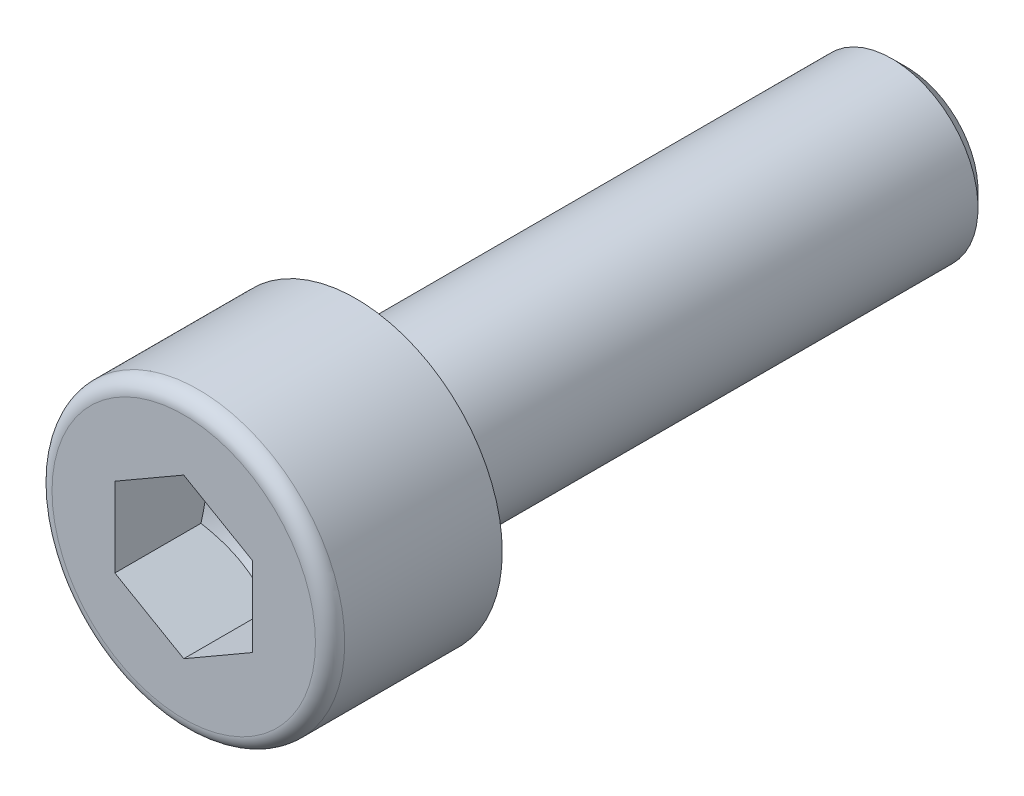
ISO-10303-21;
HEADER;
FILE_DESCRIPTION(('STEP AP214'),'2;1');
FILE_NAME('part.step','',(''),(''),'','','');
FILE_SCHEMA(('AUTOMOTIVE_DESIGN { 1 0 10303 214 1 1 1 1 }'));
ENDSEC;
DATA;
#1=APPLICATION_CONTEXT('core data for automotive mechanical design processes');
#2=APPLICATION_PROTOCOL_DEFINITION('international standard','automotive_design',2000,#1);
#3=PRODUCT_CONTEXT('',#1,'mechanical');
#4=PRODUCT('Part','Part','',(#3));
#5=PRODUCT_RELATED_PRODUCT_CATEGORY('part','',(#4));
#6=PRODUCT_DEFINITION_FORMATION('','',#4);
#7=PRODUCT_DEFINITION_CONTEXT('part definition',#1,'design');
#8=PRODUCT_DEFINITION('design','',#6,#7);
#9=PRODUCT_DEFINITION_SHAPE('','',#8);
#10=(LENGTH_UNIT() NAMED_UNIT(*) SI_UNIT(.MILLI.,.METRE.));
#11=(NAMED_UNIT(*) PLANE_ANGLE_UNIT() SI_UNIT($,.RADIAN.));
#12=(NAMED_UNIT(*) SI_UNIT($,.STERADIAN.) SOLID_ANGLE_UNIT());
#13=UNCERTAINTY_MEASURE_WITH_UNIT(LENGTH_MEASURE(1.E-05),#10,'distance_accuracy_value','');
#14=(GEOMETRIC_REPRESENTATION_CONTEXT(3) GLOBAL_UNCERTAINTY_ASSIGNED_CONTEXT((#13)) GLOBAL_UNIT_ASSIGNED_CONTEXT((#10,
#11,#12)) REPRESENTATION_CONTEXT('',''));
#15=CARTESIAN_POINT('',(0.,0.,0.));
#16=DIRECTION('',(0.,0.,1.));
#17=DIRECTION('',(1.,0.,0.));
#18=AXIS2_PLACEMENT_3D('',#15,#16,#17);
#19=CARTESIAN_POINT('',(-2.125,0.,0.));
#20=DIRECTION('',(0.,0.,-1.));
#21=DIRECTION('',(-1.,0.,0.));
#22=AXIS2_PLACEMENT_3D('',#19,#20,#21);
#23=PLANE('',#22);
#24=CARTESIAN_POINT('',(0.,0.,0.));
#25=DIRECTION('',(0.,0.,-1.));
#26=DIRECTION('',(-1.,0.,0.));
#27=AXIS2_PLACEMENT_3D('',#24,#25,#26);
#28=CIRCLE('',#27,4.25);
#29=CARTESIAN_POINT('',(-4.25,0.,0.));
#30=VERTEX_POINT('',#29);
#31=EDGE_CURVE('E11',#30,#30,#28,.T.);
#32=ORIENTED_EDGE('',*,*,#31,.T.);
#33=EDGE_LOOP('',(#32));
#34=FACE_BOUND('',#33,.T.);
#35=CARTESIAN_POINT('',(0.,0.,0.));
#36=DIRECTION('',(0.,0.,1.));
#37=DIRECTION('',(-1.,0.,0.));
#38=AXIS2_PLACEMENT_3D('',#35,#36,#37);
#39=CIRCLE('',#38,2.5);
#40=CARTESIAN_POINT('',(2.5,0.,0.));
#41=VERTEX_POINT('',#40);
#42=EDGE_CURVE('E67',#41,#41,#39,.T.);
#43=ORIENTED_EDGE('',*,*,#42,.T.);
#44=EDGE_LOOP('',(#43));
#45=FACE_BOUND('',#44,.T.);
#46=ADVANCED_FACE('F16',(#34,#45),#23,.T.);
#47=CARTESIAN_POINT('',(0.,0.,2.2875));
#48=DIRECTION('',(0.,0.,1.));
#49=DIRECTION('',(-1.,0.,0.));
#50=AXIS2_PLACEMENT_3D('',#47,#48,#49);
#51=CYLINDRICAL_SURFACE('',#50,4.25);
#52=CARTESIAN_POINT('',(0.,0.,4.575));
#53=DIRECTION('',(0.,0.,-1.));
#54=DIRECTION('',(-1.,0.,0.));
#55=AXIS2_PLACEMENT_3D('',#52,#53,#54);
#56=CIRCLE('',#55,4.25);
#57=CARTESIAN_POINT('',(-4.25,0.,4.575));
#58=VERTEX_POINT('',#57);
#59=EDGE_CURVE('E26',#58,#58,#56,.T.);
#60=ORIENTED_EDGE('',*,*,#59,.T.);
#61=EDGE_LOOP('',(#60));
#62=FACE_BOUND('',#61,.T.);
#63=ORIENTED_EDGE('',*,*,#31,.F.);
#64=EDGE_LOOP('',(#63));
#65=FACE_BOUND('',#64,.T.);
#66=ADVANCED_FACE('F206',(#62,#65),#51,.T.);
#67=CARTESIAN_POINT('',(0.,0.,4.575));
#68=DIRECTION('',(0.,0.,-1.));
#69=DIRECTION('',(0.,-1.,0.));
#70=AXIS2_PLACEMENT_3D('',#67,#68,#69);
#71=TOROIDAL_SURFACE('',#70,3.825,0.425);
#72=CARTESIAN_POINT('',(0.,0.,5.));
#73=DIRECTION('',(0.,0.,-1.));
#74=DIRECTION('',(-1.,0.,0.));
#75=AXIS2_PLACEMENT_3D('',#72,#73,#74);
#76=CIRCLE('',#75,3.825);
#77=CARTESIAN_POINT('',(-3.825,0.,5.));
#78=VERTEX_POINT('',#77);
#79=EDGE_CURVE('E124',#78,#78,#76,.T.);
#80=ORIENTED_EDGE('',*,*,#79,.T.);
#81=EDGE_LOOP('',(#80));
#82=FACE_BOUND('',#81,.T.);
#83=ORIENTED_EDGE('',*,*,#59,.F.);
#84=EDGE_LOOP('',(#83));
#85=FACE_BOUND('',#84,.T.);
#86=ADVANCED_FACE('F210',(#82,#85),#71,.T.);
#87=CARTESIAN_POINT('',(-1.9125,0.,5.));
#88=DIRECTION('',(0.,0.,1.));
#89=DIRECTION('',(1.,0.,0.));
#90=AXIS2_PLACEMENT_3D('',#87,#88,#89);
#91=PLANE('',#90);
#92=ORIENTED_EDGE('',*,*,#79,.F.);
#93=EDGE_LOOP('',(#92));
#94=FACE_BOUND('',#93,.T.);
#95=DIRECTION('',(-0.866025403784439,-0.5,0.));
#96=VECTOR('',#95,1.);
#97=CARTESIAN_POINT('',(0.282812033749892,-2.14611839618444,5.));
#98=LINE('',#97,#96);
#99=CARTESIAN_POINT('',(1.99999906749978,-1.1547,5.));
#100=VERTEX_POINT('',#99);
#101=CARTESIAN_POINT('',(0.,-2.3094,5.));
#102=VERTEX_POINT('',#101);
#103=EDGE_CURVE('E91',#100,#102,#98,.T.);
#104=ORIENTED_EDGE('',*,*,#103,.T.);
#105=DIRECTION('',(-0.866025403784439,0.5,0.));
#106=VECTOR('',#105,1.);
#107=CARTESIAN_POINT('',(-1.71718703374989,-1.31798160381557,5.));
#108=LINE('',#107,#106);
#109=CARTESIAN_POINT('',(-1.99999906749978,-1.1547,5.));
#110=VERTEX_POINT('',#109);
#111=EDGE_CURVE('E87',#102,#110,#108,.T.);
#112=ORIENTED_EDGE('',*,*,#111,.T.);
#113=DIRECTION('',(0.,1.,0.));
#114=VECTOR('',#113,1.);
#115=CARTESIAN_POINT('',(-1.99999906749978,0.,5.));
#116=LINE('',#115,#114);
#117=CARTESIAN_POINT('',(-1.99999906749978,1.1547,5.));
#118=VERTEX_POINT('',#117);
#119=EDGE_CURVE('E121',#110,#118,#116,.T.);
#120=ORIENTED_EDGE('',*,*,#119,.T.);
#121=DIRECTION('',(0.866025403784439,0.5,0.));
#122=VECTOR('',#121,1.);
#123=CARTESIAN_POINT('',(-1.71718703374989,1.31798160381557,5.));
#124=LINE('',#123,#122);
#125=CARTESIAN_POINT('',(0.,2.3094,5.));
#126=VERTEX_POINT('',#125);
#127=EDGE_CURVE('E122',#118,#126,#124,.T.);
#128=ORIENTED_EDGE('',*,*,#127,.T.);
#129=DIRECTION('',(0.866025403784439,-0.5,0.));
#130=VECTOR('',#129,1.);
#131=CARTESIAN_POINT('',(0.282812033749892,2.14611839618444,5.));
#132=LINE('',#131,#130);
#133=CARTESIAN_POINT('',(1.99999906749978,1.1547,5.));
#134=VERTEX_POINT('',#133);
#135=EDGE_CURVE('E136',#126,#134,#132,.T.);
#136=ORIENTED_EDGE('',*,*,#135,.T.);
#137=DIRECTION('',(0.,-1.,0.));
#138=VECTOR('',#137,1.);
#139=CARTESIAN_POINT('',(1.99999906749978,0.,5.));
#140=LINE('',#139,#138);
#141=EDGE_CURVE('E114',#134,#100,#140,.T.);
#142=ORIENTED_EDGE('',*,*,#141,.T.);
#143=EDGE_LOOP('',(#104,#112,#120,#128,#136,#142));
#144=FACE_BOUND('',#143,.T.);
#145=ADVANCED_FACE('F176',(#94,#144),#91,.T.);
#146=CARTESIAN_POINT('',(-1.0335,0.,-16.));
#147=DIRECTION('',(0.,0.,-1.));
#148=DIRECTION('',(-1.,0.,0.));
#149=AXIS2_PLACEMENT_3D('',#146,#147,#148);
#150=PLANE('',#149);
#151=CARTESIAN_POINT('',(0.,0.,-16.));
#152=DIRECTION('',(0.,0.,-1.));
#153=DIRECTION('',(-1.,0.,0.));
#154=AXIS2_PLACEMENT_3D('',#151,#152,#153);
#155=CIRCLE('',#154,2.067);
#156=CARTESIAN_POINT('',(-2.067,0.,-16.));
#157=VERTEX_POINT('',#156);
#158=EDGE_CURVE('E59',#157,#157,#155,.T.);
#159=ORIENTED_EDGE('',*,*,#158,.T.);
#160=EDGE_LOOP('',(#159));
#161=FACE_BOUND('',#160,.T.);
#162=ADVANCED_FACE('F223',(#161),#150,.T.);
#163=CARTESIAN_POINT('',(0.,0.,-15.7835));
#164=DIRECTION('',(0.,0.,1.));
#165=DIRECTION('',(-1.,0.,0.));
#166=AXIS2_PLACEMENT_3D('',#163,#164,#165);
#167=CONICAL_SURFACE('',#166,2.2835,0.785398163397448);
#168=CARTESIAN_POINT('',(0.,0.,-15.567));
#169=DIRECTION('',(0.,0.,-1.));
#170=DIRECTION('',(-1.,0.,0.));
#171=AXIS2_PLACEMENT_3D('',#168,#169,#170);
#172=CIRCLE('',#171,2.5);
#173=CARTESIAN_POINT('',(-2.5,0.,-15.567));
#174=VERTEX_POINT('',#173);
#175=EDGE_CURVE('E131',#174,#174,#172,.T.);
#176=ORIENTED_EDGE('',*,*,#175,.T.);
#177=EDGE_LOOP('',(#176));
#178=FACE_BOUND('',#177,.T.);
#179=ORIENTED_EDGE('',*,*,#158,.F.);
#180=EDGE_LOOP('',(#179));
#181=FACE_BOUND('',#180,.T.);
#182=ADVANCED_FACE('F228',(#178,#181),#167,.T.);
#183=CARTESIAN_POINT('',(0.,0.,-7.2835));
#184=DIRECTION('',(0.,0.,1.));
#185=DIRECTION('',(-1.,0.,0.));
#186=AXIS2_PLACEMENT_3D('',#183,#184,#185);
#187=CYLINDRICAL_SURFACE('',#186,2.5);
#188=ORIENTED_EDGE('',*,*,#42,.F.);
#189=EDGE_LOOP('',(#188));
#190=FACE_BOUND('',#189,.T.);
#191=ORIENTED_EDGE('',*,*,#175,.F.);
#192=EDGE_LOOP('',(#191));
#193=FACE_BOUND('',#192,.T.);
#194=ADVANCED_FACE('F237',(#190,#193),#187,.T.);
#195=CARTESIAN_POINT('',(-0.999999533749891,-1.73205,5.));
#196=DIRECTION('',(-0.5,-0.866025403784439,0.));
#197=DIRECTION('',(-0.866025403784439,0.5,0.));
#198=AXIS2_PLACEMENT_3D('',#195,#196,#197);
#199=PLANE('',#198);
#200=CARTESIAN_POINT('',(0.,-2.3094,2.5));
#201=CARTESIAN_POINT('',(-0.999999533749893,-1.73205,2.16666682208337));
#202=CARTESIAN_POINT('',(-1.99999906749978,-1.1547,2.5));
#203=(BOUNDED_CURVE() B_SPLINE_CURVE(2,(#200,#201,#202),.UNSPECIFIED.,.F.,
.F.) B_SPLINE_CURVE_WITH_KNOTS((3,3),(0.,2.33687118658889),
.UNSPECIFIED.) CURVE() GEOMETRIC_REPRESENTATION_ITEM() RATIONAL_B_SPLINE_CURVE((1.,
1.15470053837925,1.)) REPRESENTATION_ITEM(''));
#204=CARTESIAN_POINT('',(0.,-2.3094,2.5));
#205=VERTEX_POINT('',#204);
#206=CARTESIAN_POINT('',(-1.99999906749978,-1.1547,2.5));
#207=VERTEX_POINT('',#206);
#208=EDGE_CURVE('E84',#205,#207,#203,.T.);
#209=ORIENTED_EDGE('',*,*,#208,.T.);
#210=DIRECTION('',(0.,0.,-1.));
#211=VECTOR('',#210,1.);
#212=CARTESIAN_POINT('',(-1.99999906749978,-1.1547,5.));
#213=LINE('',#212,#211);
#214=EDGE_CURVE('E127',#110,#207,#213,.T.);
#215=ORIENTED_EDGE('',*,*,#214,.F.);
#216=ORIENTED_EDGE('',*,*,#111,.F.);
#217=DIRECTION('',(0.,0.,-1.));
#218=VECTOR('',#217,1.);
#219=CARTESIAN_POINT('',(0.,-2.3094,5.));
#220=LINE('',#219,#218);
#221=EDGE_CURVE('E20',#102,#205,#220,.T.);
#222=ORIENTED_EDGE('',*,*,#221,.T.);
#223=EDGE_LOOP('',(#209,#215,#216,#222));
#224=FACE_BOUND('',#223,.T.);
#225=ADVANCED_FACE('F81',(#224),#199,.F.);
#226=CARTESIAN_POINT('',(-1.99999906749978,0.,5.));
#227=DIRECTION('',(-1.,0.,0.));
#228=DIRECTION('',(0.,1.,0.));
#229=AXIS2_PLACEMENT_3D('',#226,#227,#228);
#230=PLANE('',#229);
#231=CARTESIAN_POINT('',(-1.99999906749978,-1.1547,2.5));
#232=CARTESIAN_POINT('',(-1.99999906749979,0.,2.16666682208337));
#233=CARTESIAN_POINT('',(-1.99999906749978,1.1547,2.5));
#234=(BOUNDED_CURVE() B_SPLINE_CURVE(2,(#231,#232,#233),.UNSPECIFIED.,.F.,
.F.) B_SPLINE_CURVE_WITH_KNOTS((3,3),(0.,2.33687118658889),
.UNSPECIFIED.) CURVE() GEOMETRIC_REPRESENTATION_ITEM() RATIONAL_B_SPLINE_CURVE((1.,
1.15470053837925,1.)) REPRESENTATION_ITEM(''));
#235=CARTESIAN_POINT('',(-1.99999906749978,1.1547,2.5));
#236=VERTEX_POINT('',#235);
#237=EDGE_CURVE('E106',#207,#236,#234,.T.);
#238=ORIENTED_EDGE('',*,*,#237,.T.);
#239=DIRECTION('',(0.,0.,-1.));
#240=VECTOR('',#239,1.);
#241=CARTESIAN_POINT('',(-1.99999906749978,1.1547,5.));
#242=LINE('',#241,#240);
#243=EDGE_CURVE('E119',#118,#236,#242,.T.);
#244=ORIENTED_EDGE('',*,*,#243,.F.);
#245=ORIENTED_EDGE('',*,*,#119,.F.);
#246=ORIENTED_EDGE('',*,*,#214,.T.);
#247=EDGE_LOOP('',(#238,#244,#245,#246));
#248=FACE_BOUND('',#247,.T.);
#249=ADVANCED_FACE('F217',(#248),#230,.F.);
#250=CARTESIAN_POINT('',(-0.999999533749891,1.73205,5.));
#251=DIRECTION('',(-0.5,0.866025403784439,0.));
#252=DIRECTION('',(0.866025403784439,0.5,0.));
#253=AXIS2_PLACEMENT_3D('',#250,#251,#252);
#254=PLANE('',#253);
#255=CARTESIAN_POINT('',(-1.99999906749978,1.1547,2.5));
#256=CARTESIAN_POINT('',(-0.999999533749893,1.73205,2.16666682208337));
#257=CARTESIAN_POINT('',(0.,2.3094,2.5));
#258=(BOUNDED_CURVE() B_SPLINE_CURVE(2,(#255,#256,#257),.UNSPECIFIED.,.F.,
.F.) B_SPLINE_CURVE_WITH_KNOTS((3,3),(0.,2.33687118658889),
.UNSPECIFIED.) CURVE() GEOMETRIC_REPRESENTATION_ITEM() RATIONAL_B_SPLINE_CURVE((1.,
1.15470053837925,1.)) REPRESENTATION_ITEM(''));
#259=CARTESIAN_POINT('',(0.,2.3094,2.5));
#260=VERTEX_POINT('',#259);
#261=EDGE_CURVE('E108',#236,#260,#258,.T.);
#262=ORIENTED_EDGE('',*,*,#261,.T.);
#263=DIRECTION('',(0.,0.,-1.));
#264=VECTOR('',#263,1.);
#265=CARTESIAN_POINT('',(0.,2.3094,5.));
#266=LINE('',#265,#264);
#267=EDGE_CURVE('E139',#126,#260,#266,.T.);
#268=ORIENTED_EDGE('',*,*,#267,.F.);
#269=ORIENTED_EDGE('',*,*,#127,.F.);
#270=ORIENTED_EDGE('',*,*,#243,.T.);
#271=EDGE_LOOP('',(#262,#268,#269,#270));
#272=FACE_BOUND('',#271,.T.);
#273=ADVANCED_FACE('F185',(#272),#254,.F.);
#274=CARTESIAN_POINT('',(0.999999533749892,1.73205,5.));
#275=DIRECTION('',(0.5,0.866025403784439,0.));
#276=DIRECTION('',(0.866025403784439,-0.5,0.));
#277=AXIS2_PLACEMENT_3D('',#274,#275,#276);
#278=PLANE('',#277);
#279=CARTESIAN_POINT('',(0.,2.3094,2.5));
#280=CARTESIAN_POINT('',(0.999999533749891,1.73205,2.16666682208337));
#281=CARTESIAN_POINT('',(1.99999906749978,1.1547,2.5));
#282=(BOUNDED_CURVE() B_SPLINE_CURVE(2,(#279,#280,#281),.UNSPECIFIED.,.F.,
.F.) B_SPLINE_CURVE_WITH_KNOTS((3,3),(0.,2.33687118658888),
.UNSPECIFIED.) CURVE() GEOMETRIC_REPRESENTATION_ITEM() RATIONAL_B_SPLINE_CURVE((1.,
1.15470053837925,1.)) REPRESENTATION_ITEM(''));
#283=CARTESIAN_POINT('',(1.99999906749978,1.1547,2.5));
#284=VERTEX_POINT('',#283);
#285=EDGE_CURVE('E92',#260,#284,#282,.T.);
#286=ORIENTED_EDGE('',*,*,#285,.T.);
#287=DIRECTION('',(0.,0.,-1.));
#288=VECTOR('',#287,1.);
#289=CARTESIAN_POINT('',(1.99999906749978,1.1547,5.));
#290=LINE('',#289,#288);
#291=EDGE_CURVE('E140',#134,#284,#290,.T.);
#292=ORIENTED_EDGE('',*,*,#291,.F.);
#293=ORIENTED_EDGE('',*,*,#135,.F.);
#294=ORIENTED_EDGE('',*,*,#267,.T.);
#295=EDGE_LOOP('',(#286,#292,#293,#294));
#296=FACE_BOUND('',#295,.T.);
#297=ADVANCED_FACE('F18',(#296),#278,.F.);
#298=CARTESIAN_POINT('',(1.99999906749978,0.,5.));
#299=DIRECTION('',(1.,0.,0.));
#300=DIRECTION('',(0.,-1.,0.));
#301=AXIS2_PLACEMENT_3D('',#298,#299,#300);
#302=PLANE('',#301);
#303=CARTESIAN_POINT('',(1.99999906749978,1.1547,2.5));
#304=CARTESIAN_POINT('',(1.99999906749979,0.,2.16666682208337));
#305=CARTESIAN_POINT('',(1.99999906749978,-1.1547,2.5));
#306=(BOUNDED_CURVE() B_SPLINE_CURVE(2,(#303,#304,#305),.UNSPECIFIED.,.F.,
.F.) B_SPLINE_CURVE_WITH_KNOTS((3,3),(0.,2.33687118658889),
.UNSPECIFIED.) CURVE() GEOMETRIC_REPRESENTATION_ITEM() RATIONAL_B_SPLINE_CURVE((1.,
1.15470053837925,1.)) REPRESENTATION_ITEM(''));
#307=CARTESIAN_POINT('',(1.99999906749978,-1.1547,2.5));
#308=VERTEX_POINT('',#307);
#309=EDGE_CURVE('E101',#284,#308,#306,.T.);
#310=ORIENTED_EDGE('',*,*,#309,.T.);
#311=DIRECTION('',(0.,0.,-1.));
#312=VECTOR('',#311,1.);
#313=CARTESIAN_POINT('',(1.99999906749978,-1.1547,5.));
#314=LINE('',#313,#312);
#315=EDGE_CURVE('E97',#100,#308,#314,.T.);
#316=ORIENTED_EDGE('',*,*,#315,.F.);
#317=ORIENTED_EDGE('',*,*,#141,.F.);
#318=ORIENTED_EDGE('',*,*,#291,.T.);
#319=EDGE_LOOP('',(#310,#316,#317,#318));
#320=FACE_BOUND('',#319,.T.);
#321=ADVANCED_FACE('F191',(#320),#302,.F.);
#322=CARTESIAN_POINT('',(0.999999533749891,-1.73205,5.));
#323=DIRECTION('',(0.5,-0.866025403784439,0.));
#324=DIRECTION('',(-0.866025403784439,-0.5,0.));
#325=AXIS2_PLACEMENT_3D('',#322,#323,#324);
#326=PLANE('',#325);
#327=CARTESIAN_POINT('',(1.99999906749978,-1.1547,2.5));
#328=CARTESIAN_POINT('',(0.999999533749891,-1.73205,2.16666682208337));
#329=CARTESIAN_POINT('',(0.,-2.3094,2.5));
#330=(BOUNDED_CURVE() B_SPLINE_CURVE(2,(#327,#328,#329),.UNSPECIFIED.,.F.,
.F.) B_SPLINE_CURVE_WITH_KNOTS((3,3),(0.,2.33687118658889),
.UNSPECIFIED.) CURVE() GEOMETRIC_REPRESENTATION_ITEM() RATIONAL_B_SPLINE_CURVE((1.,
1.15470053837925,1.)) REPRESENTATION_ITEM(''));
#331=EDGE_CURVE('E94',#308,#205,#330,.T.);
#332=ORIENTED_EDGE('',*,*,#331,.T.);
#333=ORIENTED_EDGE('',*,*,#221,.F.);
#334=ORIENTED_EDGE('',*,*,#103,.F.);
#335=ORIENTED_EDGE('',*,*,#315,.T.);
#336=EDGE_LOOP('',(#332,#333,#334,#335));
#337=FACE_BOUND('',#336,.T.);
#338=ADVANCED_FACE('F95',(#337),#326,.F.);
#339=CARTESIAN_POINT('',(0.,0.,1.83333364416674));
#340=DIRECTION('',(0.,0.,1.));
#341=DIRECTION('',(-1.,0.,0.));
#342=AXIS2_PLACEMENT_3D('',#339,#340,#341);
#343=CONICAL_SURFACE('',#342,1.1547,1.0471975511966);
#344=CARTESIAN_POINT('',(0.,0.,1.16666728833348));
#345=VERTEX_POINT('',#344);
#346=VERTEX_LOOP('',#345);
#347=FACE_BOUND('',#346,.T.);
#348=ORIENTED_EDGE('',*,*,#261,.F.);
#349=ORIENTED_EDGE('',*,*,#237,.F.);
#350=ORIENTED_EDGE('',*,*,#208,.F.);
#351=ORIENTED_EDGE('',*,*,#331,.F.);
#352=ORIENTED_EDGE('',*,*,#309,.F.);
#353=ORIENTED_EDGE('',*,*,#285,.F.);
#354=EDGE_LOOP('',(#348,#349,#350,#351,#352,#353));
#355=FACE_BOUND('',#354,.T.);
#356=ADVANCED_FACE('F104',(#347,#355),#343,.F.);
#357=CLOSED_SHELL('',(#46,#66,#86,#145,#162,#182,#194,#225,#249,#273,#297,#321,#338,#356));
#358=MANIFOLD_SOLID_BREP('B1',#357);
#359=ADVANCED_BREP_SHAPE_REPRESENTATION('',(#18,#358),#14);
#360=SHAPE_DEFINITION_REPRESENTATION(#9,#359);
ENDSEC;
END-ISO-10303-21;
